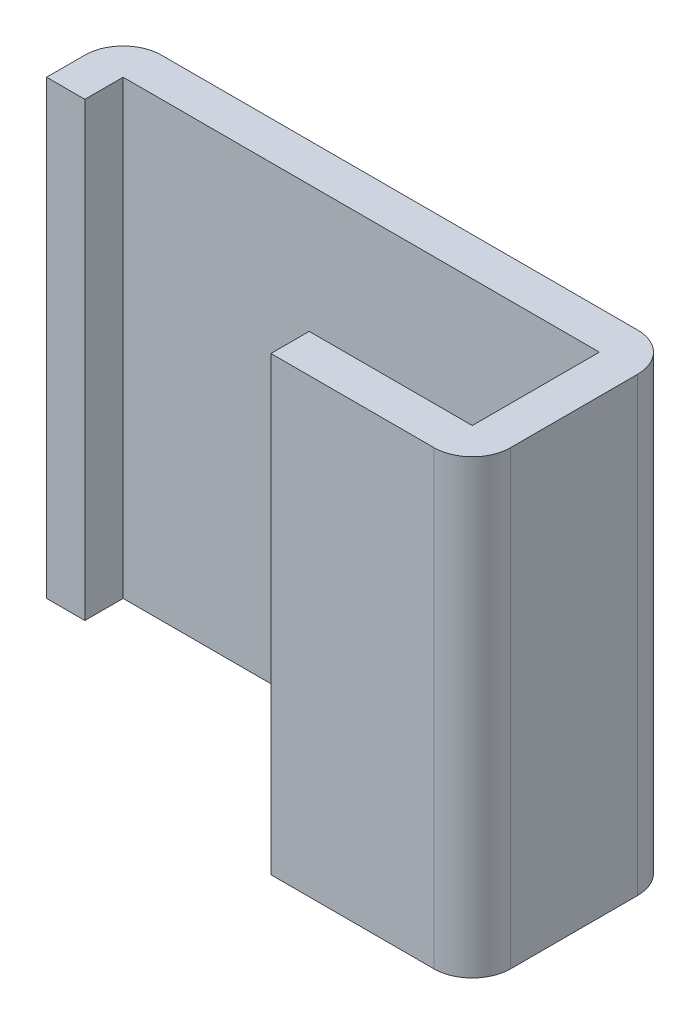
ISO-10303-21;
HEADER;
FILE_DESCRIPTION(('STEP AP214'),'2;1');
FILE_NAME('part.step','',(''),(''),'','','');
FILE_SCHEMA(('AUTOMOTIVE_DESIGN { 1 0 10303 214 1 1 1 1 }'));
ENDSEC;
DATA;
#1=APPLICATION_CONTEXT('core data for automotive mechanical design processes');
#2=APPLICATION_PROTOCOL_DEFINITION('international standard','automotive_design',2000,#1);
#3=PRODUCT_CONTEXT('',#1,'mechanical');
#4=PRODUCT('Part','Part','',(#3));
#5=PRODUCT_RELATED_PRODUCT_CATEGORY('part','',(#4));
#6=PRODUCT_DEFINITION_FORMATION('','',#4);
#7=PRODUCT_DEFINITION_CONTEXT('part definition',#1,'design');
#8=PRODUCT_DEFINITION('design','',#6,#7);
#9=PRODUCT_DEFINITION_SHAPE('','',#8);
#10=(LENGTH_UNIT() NAMED_UNIT(*) SI_UNIT(.MILLI.,.METRE.));
#11=(NAMED_UNIT(*) PLANE_ANGLE_UNIT() SI_UNIT($,.RADIAN.));
#12=(NAMED_UNIT(*) SI_UNIT($,.STERADIAN.) SOLID_ANGLE_UNIT());
#13=UNCERTAINTY_MEASURE_WITH_UNIT(LENGTH_MEASURE(1.E-05),#10,'distance_accuracy_value','');
#14=(GEOMETRIC_REPRESENTATION_CONTEXT(3) GLOBAL_UNCERTAINTY_ASSIGNED_CONTEXT((#13)) GLOBAL_UNIT_ASSIGNED_CONTEXT((#10,
#11,#12)) REPRESENTATION_CONTEXT('',''));
#15=CARTESIAN_POINT('',(0.,0.,0.));
#16=DIRECTION('',(0.,0.,1.));
#17=DIRECTION('',(1.,0.,0.));
#18=AXIS2_PLACEMENT_3D('',#15,#16,#17);
#19=CARTESIAN_POINT('',(0.49,-1.474,1.08));
#20=DIRECTION('',(1.,0.,0.));
#21=DIRECTION('',(0.,0.,-1.));
#22=AXIS2_PLACEMENT_3D('',#19,#20,#21);
#23=PLANE('',#22);
#24=DIRECTION('',(0.,1.,0.));
#25=VECTOR('',#24,1.);
#26=CARTESIAN_POINT('',(0.49,-1.474,1.33));
#27=LINE('',#26,#25);
#28=CARTESIAN_POINT('',(0.49,1.474,1.33));
#29=VERTEX_POINT('',#28);
#30=CARTESIAN_POINT('',(0.49,-1.474,1.33));
#31=VERTEX_POINT('',#30);
#32=EDGE_CURVE('E98',#29,#31,#27,.F.);
#33=ORIENTED_EDGE('',*,*,#32,.F.);
#34=DIRECTION('',(0.,0.,-1.));
#35=VECTOR('',#34,1.);
#36=CARTESIAN_POINT('',(0.49,1.474,1.08));
#37=LINE('',#36,#35);
#38=CARTESIAN_POINT('',(0.49,1.474,1.08));
#39=VERTEX_POINT('',#38);
#40=EDGE_CURVE('E103',#39,#29,#37,.F.);
#41=ORIENTED_EDGE('',*,*,#40,.F.);
#42=DIRECTION('',(0.,1.,0.));
#43=VECTOR('',#42,1.);
#44=CARTESIAN_POINT('',(0.49,-1.474,1.08));
#45=LINE('',#44,#43);
#46=CARTESIAN_POINT('',(0.49,-1.474,1.08));
#47=VERTEX_POINT('',#46);
#48=EDGE_CURVE('E127',#39,#47,#45,.F.);
#49=ORIENTED_EDGE('',*,*,#48,.T.);
#50=DIRECTION('',(0.,0.,-1.));
#51=VECTOR('',#50,1.);
#52=CARTESIAN_POINT('',(0.49,-1.474,1.08));
#53=LINE('',#52,#51);
#54=EDGE_CURVE('E84',#31,#47,#53,.T.);
#55=ORIENTED_EDGE('',*,*,#54,.F.);
#56=EDGE_LOOP('',(#33,#41,#49,#55));
#57=FACE_BOUND('',#56,.T.);
#58=ADVANCED_FACE('F17',(#57),#23,.F.);
#59=CARTESIAN_POINT('',(1.555,-1.474,1.33));
#60=DIRECTION('',(0.,0.,1.));
#61=DIRECTION('',(1.,0.,0.));
#62=AXIS2_PLACEMENT_3D('',#59,#60,#61);
#63=PLANE('',#62);
#64=ORIENTED_EDGE('',*,*,#32,.T.);
#65=DIRECTION('',(1.,0.,0.));
#66=VECTOR('',#65,1.);
#67=CARTESIAN_POINT('',(1.555,-1.474,1.33));
#68=LINE('',#67,#66);
#69=CARTESIAN_POINT('',(1.555,-1.474,1.33));
#70=VERTEX_POINT('',#69);
#71=EDGE_CURVE('E78',#31,#70,#68,.T.);
#72=ORIENTED_EDGE('',*,*,#71,.T.);
#73=DIRECTION('',(0.,-1.,0.));
#74=VECTOR('',#73,1.);
#75=CARTESIAN_POINT('',(1.555,-1.474,1.33));
#76=LINE('',#75,#74);
#77=CARTESIAN_POINT('',(1.555,1.474,1.33));
#78=VERTEX_POINT('',#77);
#79=EDGE_CURVE('E99',#78,#70,#76,.T.);
#80=ORIENTED_EDGE('',*,*,#79,.F.);
#81=DIRECTION('',(1.,0.,0.));
#82=VECTOR('',#81,1.);
#83=CARTESIAN_POINT('',(1.555,1.474,1.33));
#84=LINE('',#83,#82);
#85=EDGE_CURVE('E94',#78,#29,#84,.F.);
#86=ORIENTED_EDGE('',*,*,#85,.T.);
#87=EDGE_LOOP('',(#64,#72,#80,#86));
#88=FACE_BOUND('',#87,.T.);
#89=ADVANCED_FACE('F96',(#88),#63,.T.);
#90=CARTESIAN_POINT('',(1.555,-1.474,1.08));
#91=DIRECTION('',(0.,0.,1.));
#92=DIRECTION('',(1.,0.,0.));
#93=AXIS2_PLACEMENT_3D('',#90,#91,#92);
#94=PLANE('',#93);
#95=ORIENTED_EDGE('',*,*,#48,.F.);
#96=DIRECTION('',(1.,0.,0.));
#97=VECTOR('',#96,1.);
#98=CARTESIAN_POINT('',(1.555,1.474,1.08));
#99=LINE('',#98,#97);
#100=CARTESIAN_POINT('',(1.555,1.474,1.08));
#101=VERTEX_POINT('',#100);
#102=EDGE_CURVE('E108',#101,#39,#99,.F.);
#103=ORIENTED_EDGE('',*,*,#102,.F.);
#104=DIRECTION('',(0.,1.,0.));
#105=VECTOR('',#104,1.);
#106=CARTESIAN_POINT('',(1.555,-1.474,1.08));
#107=LINE('',#106,#105);
#108=CARTESIAN_POINT('',(1.555,-1.474,1.08));
#109=VERTEX_POINT('',#108);
#110=EDGE_CURVE('E181',#101,#109,#107,.F.);
#111=ORIENTED_EDGE('',*,*,#110,.T.);
#112=DIRECTION('',(1.,0.,0.));
#113=VECTOR('',#112,1.);
#114=CARTESIAN_POINT('',(1.555,-1.474,1.08));
#115=LINE('',#114,#113);
#116=EDGE_CURVE('E125',#47,#109,#115,.T.);
#117=ORIENTED_EDGE('',*,*,#116,.F.);
#118=EDGE_LOOP('',(#95,#103,#111,#117));
#119=FACE_BOUND('',#118,.T.);
#120=ADVANCED_FACE('F379',(#119),#94,.F.);
#121=CARTESIAN_POINT('',(1.555,-1.474,1.08));
#122=DIRECTION('',(0.,-1.,0.));
#123=DIRECTION('',(0.,0.,-1.));
#124=AXIS2_PLACEMENT_3D('',#121,#122,#123);
#125=CYLINDRICAL_SURFACE('',#124,0.25);
#126=CARTESIAN_POINT('',(1.555,1.474,1.08));
#127=DIRECTION('',(0.,-1.,0.));
#128=DIRECTION('',(0.,0.,-1.));
#129=AXIS2_PLACEMENT_3D('',#126,#127,#128);
#130=CIRCLE('',#129,0.25);
#131=CARTESIAN_POINT('',(1.805,1.474,1.08));
#132=VERTEX_POINT('',#131);
#133=EDGE_CURVE('E147',#132,#78,#130,.T.);
#134=ORIENTED_EDGE('',*,*,#133,.T.);
#135=ORIENTED_EDGE('',*,*,#79,.T.);
#136=CARTESIAN_POINT('',(1.555,-1.474,1.08));
#137=DIRECTION('',(0.,-1.,0.));
#138=DIRECTION('',(0.,0.,-1.));
#139=AXIS2_PLACEMENT_3D('',#136,#137,#138);
#140=CIRCLE('',#139,0.25);
#141=CARTESIAN_POINT('',(1.805,-1.474,1.08));
#142=VERTEX_POINT('',#141);
#143=EDGE_CURVE('E20',#70,#142,#140,.F.);
#144=ORIENTED_EDGE('',*,*,#143,.T.);
#145=DIRECTION('',(0.,1.,0.));
#146=VECTOR('',#145,1.);
#147=CARTESIAN_POINT('',(1.805,-1.474,1.08));
#148=LINE('',#147,#146);
#149=EDGE_CURVE('E156',#142,#132,#148,.T.);
#150=ORIENTED_EDGE('',*,*,#149,.T.);
#151=EDGE_LOOP('',(#134,#135,#144,#150));
#152=FACE_BOUND('',#151,.T.);
#153=ADVANCED_FACE('F155',(#152),#125,.T.);
#154=CARTESIAN_POINT('',(-1.805,-1.474,0.5));
#155=DIRECTION('',(0.,0.,-1.));
#156=DIRECTION('',(-1.,0.,0.));
#157=AXIS2_PLACEMENT_3D('',#154,#155,#156);
#158=PLANE('',#157);
#159=DIRECTION('',(0.,1.,0.));
#160=VECTOR('',#159,1.);
#161=CARTESIAN_POINT('',(-1.555,-1.474,0.5));
#162=LINE('',#161,#160);
#163=CARTESIAN_POINT('',(-1.555,-1.474,0.5));
#164=VERTEX_POINT('',#163);
#165=CARTESIAN_POINT('',(-1.555,1.474,0.5));
#166=VERTEX_POINT('',#165);
#167=EDGE_CURVE('E194',#164,#166,#162,.T.);
#168=ORIENTED_EDGE('',*,*,#167,.T.);
#169=DIRECTION('',(-1.,0.,0.));
#170=VECTOR('',#169,1.);
#171=CARTESIAN_POINT('',(-1.805,1.474,0.5));
#172=LINE('',#171,#170);
#173=CARTESIAN_POINT('',(-1.805,1.474,0.5));
#174=VERTEX_POINT('',#173);
#175=EDGE_CURVE('E150',#174,#166,#172,.F.);
#176=ORIENTED_EDGE('',*,*,#175,.F.);
#177=DIRECTION('',(0.,1.,0.));
#178=VECTOR('',#177,1.);
#179=CARTESIAN_POINT('',(-1.805,-1.474,0.5));
#180=LINE('',#179,#178);
#181=CARTESIAN_POINT('',(-1.805,-1.474,0.5));
#182=VERTEX_POINT('',#181);
#183=EDGE_CURVE('E171',#174,#182,#180,.F.);
#184=ORIENTED_EDGE('',*,*,#183,.T.);
#185=DIRECTION('',(-1.,0.,0.));
#186=VECTOR('',#185,1.);
#187=CARTESIAN_POINT('',(-1.805,-1.474,0.5));
#188=LINE('',#187,#186);
#189=EDGE_CURVE('E189',#164,#182,#188,.T.);
#190=ORIENTED_EDGE('',*,*,#189,.F.);
#191=EDGE_LOOP('',(#168,#176,#184,#190));
#192=FACE_BOUND('',#191,.T.);
#193=ADVANCED_FACE('F278',(#192),#158,.F.);
#194=CARTESIAN_POINT('',(-1.555,-1.474,0.5));
#195=DIRECTION('',(-1.,0.,0.));
#196=DIRECTION('',(0.,0.,1.));
#197=AXIS2_PLACEMENT_3D('',#194,#195,#196);
#198=PLANE('',#197);
#199=DIRECTION('',(0.,1.,0.));
#200=VECTOR('',#199,1.);
#201=CARTESIAN_POINT('',(-1.555,-1.474,0.25));
#202=LINE('',#201,#200);
#203=CARTESIAN_POINT('',(-1.555,-1.474,0.25));
#204=VERTEX_POINT('',#203);
#205=CARTESIAN_POINT('',(-1.555,1.474,0.25));
#206=VERTEX_POINT('',#205);
#207=EDGE_CURVE('E222',#204,#206,#202,.T.);
#208=ORIENTED_EDGE('',*,*,#207,.T.);
#209=DIRECTION('',(0.,0.,1.));
#210=VECTOR('',#209,1.);
#211=CARTESIAN_POINT('',(-1.555,1.474,0.5));
#212=LINE('',#211,#210);
#213=EDGE_CURVE('E199',#166,#206,#212,.F.);
#214=ORIENTED_EDGE('',*,*,#213,.F.);
#215=ORIENTED_EDGE('',*,*,#167,.F.);
#216=DIRECTION('',(0.,0.,1.));
#217=VECTOR('',#216,1.);
#218=CARTESIAN_POINT('',(-1.555,-1.474,0.5));
#219=LINE('',#218,#217);
#220=EDGE_CURVE('E186',#204,#164,#219,.T.);
#221=ORIENTED_EDGE('',*,*,#220,.F.);
#222=EDGE_LOOP('',(#208,#214,#215,#221));
#223=FACE_BOUND('',#222,.T.);
#224=ADVANCED_FACE('F223',(#223),#198,.F.);
#225=CARTESIAN_POINT('',(1.555,-1.474,0.25));
#226=DIRECTION('',(1.,0.,0.));
#227=DIRECTION('',(0.,0.,-1.));
#228=AXIS2_PLACEMENT_3D('',#225,#226,#227);
#229=PLANE('',#228);
#230=ORIENTED_EDGE('',*,*,#110,.F.);
#231=DIRECTION('',(0.,0.,-1.));
#232=VECTOR('',#231,1.);
#233=CARTESIAN_POINT('',(1.555,1.474,0.25));
#234=LINE('',#233,#232);
#235=CARTESIAN_POINT('',(1.555,1.474,0.25));
#236=VERTEX_POINT('',#235);
#237=EDGE_CURVE('E184',#236,#101,#234,.F.);
#238=ORIENTED_EDGE('',*,*,#237,.F.);
#239=DIRECTION('',(0.,1.,0.));
#240=VECTOR('',#239,1.);
#241=CARTESIAN_POINT('',(1.555,-1.474,0.25));
#242=LINE('',#241,#240);
#243=CARTESIAN_POINT('',(1.555,-1.474,0.25));
#244=VERTEX_POINT('',#243);
#245=EDGE_CURVE('E227',#236,#244,#242,.F.);
#246=ORIENTED_EDGE('',*,*,#245,.T.);
#247=DIRECTION('',(0.,0.,-1.));
#248=VECTOR('',#247,1.);
#249=CARTESIAN_POINT('',(1.555,-1.474,0.25));
#250=LINE('',#249,#248);
#251=EDGE_CURVE('E166',#109,#244,#250,.T.);
#252=ORIENTED_EDGE('',*,*,#251,.F.);
#253=EDGE_LOOP('',(#230,#238,#246,#252));
#254=FACE_BOUND('',#253,.T.);
#255=ADVANCED_FACE('F349',(#254),#229,.F.);
#256=CARTESIAN_POINT('',(1.805,-1.474,1.08));
#257=DIRECTION('',(-1.,0.,0.));
#258=DIRECTION('',(0.,0.,1.));
#259=AXIS2_PLACEMENT_3D('',#256,#257,#258);
#260=PLANE('',#259);
#261=DIRECTION('',(0.,-1.,0.));
#262=VECTOR('',#261,1.);
#263=CARTESIAN_POINT('',(1.805,-1.474,0.25));
#264=LINE('',#263,#262);
#265=CARTESIAN_POINT('',(1.805,1.474,0.25));
#266=VERTEX_POINT('',#265);
#267=CARTESIAN_POINT('',(1.805,-1.474,0.25));
#268=VERTEX_POINT('',#267);
#269=EDGE_CURVE('E146',#266,#268,#264,.T.);
#270=ORIENTED_EDGE('',*,*,#269,.F.);
#271=DIRECTION('',(0.,0.,1.));
#272=VECTOR('',#271,1.);
#273=CARTESIAN_POINT('',(1.805,1.474,1.08));
#274=LINE('',#273,#272);
#275=EDGE_CURVE('E165',#132,#266,#274,.F.);
#276=ORIENTED_EDGE('',*,*,#275,.F.);
#277=ORIENTED_EDGE('',*,*,#149,.F.);
#278=DIRECTION('',(0.,0.,1.));
#279=VECTOR('',#278,1.);
#280=CARTESIAN_POINT('',(1.805,-1.474,1.08));
#281=LINE('',#280,#279);
#282=EDGE_CURVE('E163',#268,#142,#281,.T.);
#283=ORIENTED_EDGE('',*,*,#282,.F.);
#284=EDGE_LOOP('',(#270,#276,#277,#283));
#285=FACE_BOUND('',#284,.T.);
#286=ADVANCED_FACE('F162',(#285),#260,.F.);
#287=CARTESIAN_POINT('',(-1.805,-1.474,0.25));
#288=DIRECTION('',(1.,0.,0.));
#289=DIRECTION('',(0.,0.,-1.));
#290=AXIS2_PLACEMENT_3D('',#287,#288,#289);
#291=PLANE('',#290);
#292=ORIENTED_EDGE('',*,*,#183,.F.);
#293=DIRECTION('',(0.,0.,1.));
#294=VECTOR('',#293,1.);
#295=CARTESIAN_POINT('',(-1.805,1.474,0.25));
#296=LINE('',#295,#294);
#297=CARTESIAN_POINT('',(-1.805,1.474,0.25));
#298=VERTEX_POINT('',#297);
#299=EDGE_CURVE('E145',#298,#174,#296,.T.);
#300=ORIENTED_EDGE('',*,*,#299,.F.);
#301=DIRECTION('',(0.,-1.,0.));
#302=VECTOR('',#301,1.);
#303=CARTESIAN_POINT('',(-1.805,-1.474,0.25));
#304=LINE('',#303,#302);
#305=CARTESIAN_POINT('',(-1.805,-1.474,0.25));
#306=VERTEX_POINT('',#305);
#307=EDGE_CURVE('E143',#306,#298,#304,.F.);
#308=ORIENTED_EDGE('',*,*,#307,.F.);
#309=DIRECTION('',(0.,0.,-1.));
#310=VECTOR('',#309,1.);
#311=CARTESIAN_POINT('',(-1.805,-1.474,0.25));
#312=LINE('',#311,#310);
#313=EDGE_CURVE('E174',#182,#306,#312,.T.);
#314=ORIENTED_EDGE('',*,*,#313,.F.);
#315=EDGE_LOOP('',(#292,#300,#308,#314));
#316=FACE_BOUND('',#315,.T.);
#317=ADVANCED_FACE('F252',(#316),#291,.F.);
#318=CARTESIAN_POINT('',(-1.555,-1.474,0.25));
#319=DIRECTION('',(0.,0.,-1.));
#320=DIRECTION('',(-1.,0.,0.));
#321=AXIS2_PLACEMENT_3D('',#318,#319,#320);
#322=PLANE('',#321);
#323=ORIENTED_EDGE('',*,*,#245,.F.);
#324=DIRECTION('',(1.,0.,0.));
#325=VECTOR('',#324,1.);
#326=CARTESIAN_POINT('',(1.555,1.474,0.25));
#327=LINE('',#326,#325);
#328=EDGE_CURVE('E213',#206,#236,#327,.T.);
#329=ORIENTED_EDGE('',*,*,#328,.F.);
#330=ORIENTED_EDGE('',*,*,#207,.F.);
#331=DIRECTION('',(1.,0.,0.));
#332=VECTOR('',#331,1.);
#333=CARTESIAN_POINT('',(1.555,-1.474,0.25));
#334=LINE('',#333,#332);
#335=EDGE_CURVE('E137',#204,#244,#334,.T.);
#336=ORIENTED_EDGE('',*,*,#335,.T.);
#337=EDGE_LOOP('',(#323,#329,#330,#336));
#338=FACE_BOUND('',#337,.T.);
#339=ADVANCED_FACE('F230',(#338),#322,.F.);
#340=CARTESIAN_POINT('',(1.555,-1.474,0.25));
#341=DIRECTION('',(0.,-1.,0.));
#342=DIRECTION('',(0.,0.,-1.));
#343=AXIS2_PLACEMENT_3D('',#340,#341,#342);
#344=CYLINDRICAL_SURFACE('',#343,0.25);
#345=CARTESIAN_POINT('',(1.555,1.474,0.25));
#346=DIRECTION('',(0.,-1.,0.));
#347=DIRECTION('',(0.,0.,-1.));
#348=AXIS2_PLACEMENT_3D('',#345,#346,#347);
#349=CIRCLE('',#348,0.25);
#350=CARTESIAN_POINT('',(1.555,1.474,0.));
#351=VERTEX_POINT('',#350);
#352=EDGE_CURVE('E144',#266,#351,#349,.F.);
#353=ORIENTED_EDGE('',*,*,#352,.F.);
#354=ORIENTED_EDGE('',*,*,#269,.T.);
#355=CARTESIAN_POINT('',(1.555,-1.474,0.25));
#356=DIRECTION('',(0.,-1.,0.));
#357=DIRECTION('',(0.,0.,-1.));
#358=AXIS2_PLACEMENT_3D('',#355,#356,#357);
#359=CIRCLE('',#358,0.25);
#360=CARTESIAN_POINT('',(1.555,-1.474,0.));
#361=VERTEX_POINT('',#360);
#362=EDGE_CURVE('E138',#268,#361,#359,.F.);
#363=ORIENTED_EDGE('',*,*,#362,.T.);
#364=DIRECTION('',(0.,1.,0.));
#365=VECTOR('',#364,1.);
#366=CARTESIAN_POINT('',(1.555,-1.474,0.));
#367=LINE('',#366,#365);
#368=EDGE_CURVE('E262',#361,#351,#367,.T.);
#369=ORIENTED_EDGE('',*,*,#368,.T.);
#370=EDGE_LOOP('',(#353,#354,#363,#369));
#371=FACE_BOUND('',#370,.T.);
#372=ADVANCED_FACE('F280',(#371),#344,.T.);
#373=CARTESIAN_POINT('',(1.555,1.474,0.25));
#374=DIRECTION('',(0.,1.,0.));
#375=DIRECTION('',(0.,0.,1.));
#376=AXIS2_PLACEMENT_3D('',#373,#374,#375);
#377=PLANE('',#376);
#378=ORIENTED_EDGE('',*,*,#213,.T.);
#379=ORIENTED_EDGE('',*,*,#328,.T.);
#380=ORIENTED_EDGE('',*,*,#237,.T.);
#381=ORIENTED_EDGE('',*,*,#102,.T.);
#382=ORIENTED_EDGE('',*,*,#40,.T.);
#383=ORIENTED_EDGE('',*,*,#85,.F.);
#384=ORIENTED_EDGE('',*,*,#133,.F.);
#385=ORIENTED_EDGE('',*,*,#275,.T.);
#386=ORIENTED_EDGE('',*,*,#352,.T.);
#387=DIRECTION('',(1.,0.,0.));
#388=VECTOR('',#387,1.);
#389=CARTESIAN_POINT('',(1.555,1.474,0.));
#390=LINE('',#389,#388);
#391=CARTESIAN_POINT('',(-1.555,1.474,0.));
#392=VERTEX_POINT('',#391);
#393=EDGE_CURVE('E236',#351,#392,#390,.F.);
#394=ORIENTED_EDGE('',*,*,#393,.T.);
#395=CARTESIAN_POINT('',(-1.555,1.474,0.25));
#396=DIRECTION('',(0.,-1.,0.));
#397=DIRECTION('',(0.,0.,-1.));
#398=AXIS2_PLACEMENT_3D('',#395,#396,#397);
#399=CIRCLE('',#398,0.25);
#400=EDGE_CURVE('E141',#298,#392,#399,.T.);
#401=ORIENTED_EDGE('',*,*,#400,.F.);
#402=ORIENTED_EDGE('',*,*,#299,.T.);
#403=ORIENTED_EDGE('',*,*,#175,.T.);
#404=EDGE_LOOP('',(#378,#379,#380,#381,#382,#383,#384,#385,#386,#394,#401,#402,#403));
#405=FACE_BOUND('',#404,.T.);
#406=ADVANCED_FACE('F105',(#405),#377,.T.);
#407=CARTESIAN_POINT('',(-1.555,-1.474,0.25));
#408=DIRECTION('',(0.,-1.,0.));
#409=DIRECTION('',(0.,0.,-1.));
#410=AXIS2_PLACEMENT_3D('',#407,#408,#409);
#411=CYLINDRICAL_SURFACE('',#410,0.25);
#412=ORIENTED_EDGE('',*,*,#400,.T.);
#413=DIRECTION('',(0.,1.,0.));
#414=VECTOR('',#413,1.);
#415=CARTESIAN_POINT('',(-1.555,-1.474,0.));
#416=LINE('',#415,#414);
#417=CARTESIAN_POINT('',(-1.555,-1.474,0.));
#418=VERTEX_POINT('',#417);
#419=EDGE_CURVE('E26',#392,#418,#416,.F.);
#420=ORIENTED_EDGE('',*,*,#419,.T.);
#421=CARTESIAN_POINT('',(-1.555,-1.474,0.25));
#422=DIRECTION('',(0.,-1.,0.));
#423=DIRECTION('',(0.,0.,-1.));
#424=AXIS2_PLACEMENT_3D('',#421,#422,#423);
#425=CIRCLE('',#424,0.25);
#426=EDGE_CURVE('E34',#418,#306,#425,.F.);
#427=ORIENTED_EDGE('',*,*,#426,.T.);
#428=ORIENTED_EDGE('',*,*,#307,.T.);
#429=EDGE_LOOP('',(#412,#420,#427,#428));
#430=FACE_BOUND('',#429,.T.);
#431=ADVANCED_FACE('F256',(#430),#411,.T.);
#432=CARTESIAN_POINT('',(1.555,-1.474,0.25));
#433=DIRECTION('',(0.,1.,0.));
#434=DIRECTION('',(0.,0.,1.));
#435=AXIS2_PLACEMENT_3D('',#432,#433,#434);
#436=PLANE('',#435);
#437=ORIENTED_EDGE('',*,*,#220,.T.);
#438=ORIENTED_EDGE('',*,*,#189,.T.);
#439=ORIENTED_EDGE('',*,*,#313,.T.);
#440=ORIENTED_EDGE('',*,*,#426,.F.);
#441=DIRECTION('',(1.,0.,0.));
#442=VECTOR('',#441,1.);
#443=CARTESIAN_POINT('',(1.555,-1.474,0.));
#444=LINE('',#443,#442);
#445=EDGE_CURVE('E11',#418,#361,#444,.T.);
#446=ORIENTED_EDGE('',*,*,#445,.T.);
#447=ORIENTED_EDGE('',*,*,#362,.F.);
#448=ORIENTED_EDGE('',*,*,#282,.T.);
#449=ORIENTED_EDGE('',*,*,#143,.F.);
#450=ORIENTED_EDGE('',*,*,#71,.F.);
#451=ORIENTED_EDGE('',*,*,#54,.T.);
#452=ORIENTED_EDGE('',*,*,#116,.T.);
#453=ORIENTED_EDGE('',*,*,#251,.T.);
#454=ORIENTED_EDGE('',*,*,#335,.F.);
#455=EDGE_LOOP('',(#437,#438,#439,#440,#446,#447,#448,#449,#450,#451,#452,#453,#454));
#456=FACE_BOUND('',#455,.T.);
#457=ADVANCED_FACE('F170',(#456),#436,.F.);
#458=CARTESIAN_POINT('',(1.555,-1.474,0.));
#459=DIRECTION('',(0.,0.,1.));
#460=DIRECTION('',(1.,0.,0.));
#461=AXIS2_PLACEMENT_3D('',#458,#459,#460);
#462=PLANE('',#461);
#463=ORIENTED_EDGE('',*,*,#419,.F.);
#464=ORIENTED_EDGE('',*,*,#393,.F.);
#465=ORIENTED_EDGE('',*,*,#368,.F.);
#466=ORIENTED_EDGE('',*,*,#445,.F.);
#467=EDGE_LOOP('',(#463,#464,#465,#466));
#468=FACE_BOUND('',#467,.T.);
#469=ADVANCED_FACE('F279',(#468),#462,.F.);
#470=CLOSED_SHELL('',(#58,#89,#120,#153,#193,#224,#255,#286,#317,#339,#372,#406,#431,#457,#469));
#471=MANIFOLD_SOLID_BREP('B1',#470);
#472=ADVANCED_BREP_SHAPE_REPRESENTATION('',(#18,#471),#14);
#473=SHAPE_DEFINITION_REPRESENTATION(#9,#472);
ENDSEC;
END-ISO-10303-21;
